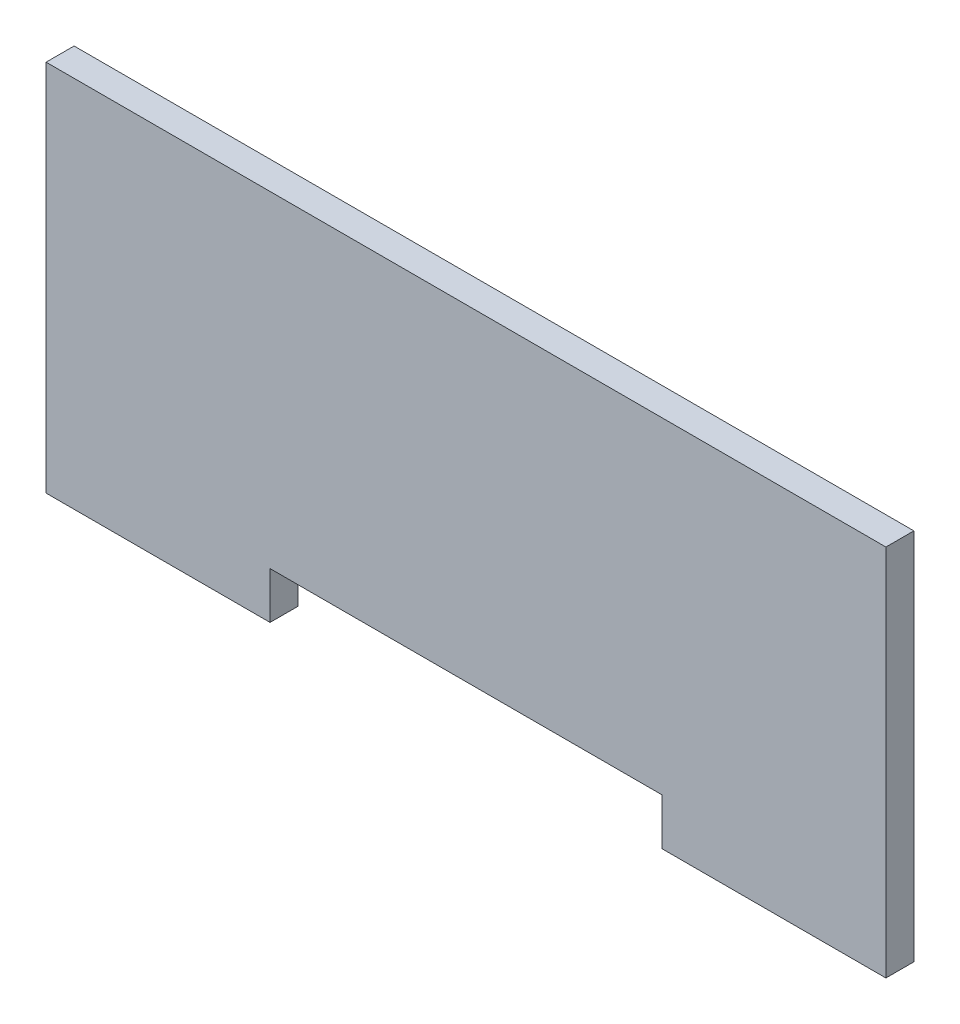
ISO-10303-21;
HEADER;
FILE_DESCRIPTION(('STEP AP214'),'2;1');
FILE_NAME('part.step','',(''),(''),'','','');
FILE_SCHEMA(('AUTOMOTIVE_DESIGN { 1 0 10303 214 1 1 1 1 }'));
ENDSEC;
DATA;
#1=APPLICATION_CONTEXT('core data for automotive mechanical design processes');
#2=APPLICATION_PROTOCOL_DEFINITION('international standard','automotive_design',2000,#1);
#3=PRODUCT_CONTEXT('',#1,'mechanical');
#4=PRODUCT('Part','Part','',(#3));
#5=PRODUCT_RELATED_PRODUCT_CATEGORY('part','',(#4));
#6=PRODUCT_DEFINITION_FORMATION('','',#4);
#7=PRODUCT_DEFINITION_CONTEXT('part definition',#1,'design');
#8=PRODUCT_DEFINITION('design','',#6,#7);
#9=PRODUCT_DEFINITION_SHAPE('','',#8);
#10=(LENGTH_UNIT() NAMED_UNIT(*) SI_UNIT(.MILLI.,.METRE.));
#11=(NAMED_UNIT(*) PLANE_ANGLE_UNIT() SI_UNIT($,.RADIAN.));
#12=(NAMED_UNIT(*) SI_UNIT($,.STERADIAN.) SOLID_ANGLE_UNIT());
#13=UNCERTAINTY_MEASURE_WITH_UNIT(LENGTH_MEASURE(1.E-05),#10,'distance_accuracy_value','');
#14=(GEOMETRIC_REPRESENTATION_CONTEXT(3) GLOBAL_UNCERTAINTY_ASSIGNED_CONTEXT((#13)) GLOBAL_UNIT_ASSIGNED_CONTEXT((#10,
#11,#12)) REPRESENTATION_CONTEXT('',''));
#15=CARTESIAN_POINT('',(0.,0.,0.));
#16=DIRECTION('',(0.,0.,1.));
#17=DIRECTION('',(1.,0.,0.));
#18=AXIS2_PLACEMENT_3D('',#15,#16,#17);
#19=CARTESIAN_POINT('',(-22.6948207171315,30.5659463337186,3.));
#20=DIRECTION('',(1.,0.,0.));
#21=DIRECTION('',(0.,1.,0.));
#22=AXIS2_PLACEMENT_3D('',#19,#20,#21);
#23=PLANE('',#22);
#24=DIRECTION('',(0.,-1.,0.));
#25=VECTOR('',#24,1.);
#26=CARTESIAN_POINT('',(-22.6948207171315,30.5659463337186,0.));
#27=LINE('',#26,#25);
#28=CARTESIAN_POINT('',(-22.6948207171315,30.5659463337186,0.));
#29=VERTEX_POINT('',#28);
#30=CARTESIAN_POINT('',(-22.6948207171315,-9.4340536662814,0.));
#31=VERTEX_POINT('',#30);
#32=EDGE_CURVE('E131',#29,#31,#27,.T.);
#33=ORIENTED_EDGE('',*,*,#32,.T.);
#34=DIRECTION('',(0.,0.,-1.));
#35=VECTOR('',#34,1.);
#36=CARTESIAN_POINT('',(-22.6948207171315,-9.4340536662814,3.));
#37=LINE('',#36,#35);
#38=CARTESIAN_POINT('',(-22.6948207171315,-9.4340536662814,3.));
#39=VERTEX_POINT('',#38);
#40=EDGE_CURVE('E11',#39,#31,#37,.T.);
#41=ORIENTED_EDGE('',*,*,#40,.F.);
#42=DIRECTION('',(0.,-1.,0.));
#43=VECTOR('',#42,1.);
#44=CARTESIAN_POINT('',(-22.6948207171315,30.5659463337186,3.));
#45=LINE('',#44,#43);
#46=CARTESIAN_POINT('',(-22.6948207171315,30.5659463337186,3.));
#47=VERTEX_POINT('',#46);
#48=EDGE_CURVE('E145',#47,#39,#45,.T.);
#49=ORIENTED_EDGE('',*,*,#48,.F.);
#50=DIRECTION('',(0.,0.,-1.));
#51=VECTOR('',#50,1.);
#52=CARTESIAN_POINT('',(-22.6948207171315,30.5659463337186,3.));
#53=LINE('',#52,#51);
#54=EDGE_CURVE('E127',#47,#29,#53,.T.);
#55=ORIENTED_EDGE('',*,*,#54,.T.);
#56=EDGE_LOOP('',(#33,#41,#49,#55));
#57=FACE_BOUND('',#56,.T.);
#58=ADVANCED_FACE('F35',(#57),#23,.F.);
#59=CARTESIAN_POINT('',(-22.6948207171315,-9.4340536662814,3.));
#60=DIRECTION('',(0.,1.,0.));
#61=DIRECTION('',(-1.,0.,0.));
#62=AXIS2_PLACEMENT_3D('',#59,#60,#61);
#63=PLANE('',#62);
#64=DIRECTION('',(1.,0.,0.));
#65=VECTOR('',#64,1.);
#66=CARTESIAN_POINT('',(-22.6948207171315,-9.4340536662814,0.));
#67=LINE('',#66,#65);
#68=CARTESIAN_POINT('',(1.30517928286851,-9.43405366628141,0.));
#69=VERTEX_POINT('',#68);
#70=EDGE_CURVE('E134',#31,#69,#67,.T.);
#71=ORIENTED_EDGE('',*,*,#70,.T.);
#72=DIRECTION('',(0.,0.,-1.));
#73=VECTOR('',#72,1.);
#74=CARTESIAN_POINT('',(1.30517928286851,-9.43405366628141,3.));
#75=LINE('',#74,#73);
#76=CARTESIAN_POINT('',(1.30517928286851,-9.43405366628141,3.));
#77=VERTEX_POINT('',#76);
#78=EDGE_CURVE('E43',#77,#69,#75,.T.);
#79=ORIENTED_EDGE('',*,*,#78,.F.);
#80=DIRECTION('',(1.,0.,0.));
#81=VECTOR('',#80,1.);
#82=CARTESIAN_POINT('',(-22.6948207171315,-9.4340536662814,3.));
#83=LINE('',#82,#81);
#84=EDGE_CURVE('E94',#39,#77,#83,.T.);
#85=ORIENTED_EDGE('',*,*,#84,.F.);
#86=ORIENTED_EDGE('',*,*,#40,.T.);
#87=EDGE_LOOP('',(#71,#79,#85,#86));
#88=FACE_BOUND('',#87,.T.);
#89=ADVANCED_FACE('F180',(#88),#63,.F.);
#90=CARTESIAN_POINT('',(1.30517928286851,-4.43405366628141,3.));
#91=DIRECTION('',(-1.,0.,0.));
#92=DIRECTION('',(0.,0.,1.));
#93=AXIS2_PLACEMENT_3D('',#90,#91,#92);
#94=PLANE('',#93);
#95=DIRECTION('',(0.,1.,0.));
#96=VECTOR('',#95,1.);
#97=CARTESIAN_POINT('',(1.30517928286851,-4.43405366628141,0.));
#98=LINE('',#97,#96);
#99=CARTESIAN_POINT('',(1.30517928286851,-4.43405366628141,0.));
#100=VERTEX_POINT('',#99);
#101=EDGE_CURVE('E136',#69,#100,#98,.T.);
#102=ORIENTED_EDGE('',*,*,#101,.T.);
#103=DIRECTION('',(0.,0.,-1.));
#104=VECTOR('',#103,1.);
#105=CARTESIAN_POINT('',(1.30517928286851,-4.43405366628141,3.));
#106=LINE('',#105,#104);
#107=CARTESIAN_POINT('',(1.30517928286851,-4.43405366628141,3.));
#108=VERTEX_POINT('',#107);
#109=EDGE_CURVE('E152',#108,#100,#106,.T.);
#110=ORIENTED_EDGE('',*,*,#109,.F.);
#111=DIRECTION('',(0.,1.,0.));
#112=VECTOR('',#111,1.);
#113=CARTESIAN_POINT('',(1.30517928286851,-4.43405366628141,3.));
#114=LINE('',#113,#112);
#115=EDGE_CURVE('E160',#77,#108,#114,.T.);
#116=ORIENTED_EDGE('',*,*,#115,.F.);
#117=ORIENTED_EDGE('',*,*,#78,.T.);
#118=EDGE_LOOP('',(#102,#110,#116,#117));
#119=FACE_BOUND('',#118,.T.);
#120=ADVANCED_FACE('F158',(#119),#94,.F.);
#121=CARTESIAN_POINT('',(1.30517928286851,-4.43405366628141,3.));
#122=DIRECTION('',(0.,1.,0.));
#123=DIRECTION('',(-1.,0.,0.));
#124=AXIS2_PLACEMENT_3D('',#121,#122,#123);
#125=PLANE('',#124);
#126=DIRECTION('',(1.,0.,0.));
#127=VECTOR('',#126,1.);
#128=CARTESIAN_POINT('',(1.30517928286851,-4.43405366628141,0.));
#129=LINE('',#128,#127);
#130=CARTESIAN_POINT('',(43.3051792828685,-4.4340536662814,0.));
#131=VERTEX_POINT('',#130);
#132=EDGE_CURVE('E138',#100,#131,#129,.T.);
#133=ORIENTED_EDGE('',*,*,#132,.T.);
#134=DIRECTION('',(0.,0.,-1.));
#135=VECTOR('',#134,1.);
#136=CARTESIAN_POINT('',(43.3051792828685,-4.4340536662814,3.));
#137=LINE('',#136,#135);
#138=CARTESIAN_POINT('',(43.3051792828685,-4.4340536662814,3.));
#139=VERTEX_POINT('',#138);
#140=EDGE_CURVE('E149',#139,#131,#137,.T.);
#141=ORIENTED_EDGE('',*,*,#140,.F.);
#142=DIRECTION('',(1.,0.,0.));
#143=VECTOR('',#142,1.);
#144=CARTESIAN_POINT('',(1.30517928286851,-4.43405366628141,3.));
#145=LINE('',#144,#143);
#146=EDGE_CURVE('E172',#108,#139,#145,.T.);
#147=ORIENTED_EDGE('',*,*,#146,.F.);
#148=ORIENTED_EDGE('',*,*,#109,.T.);
#149=EDGE_LOOP('',(#133,#141,#147,#148));
#150=FACE_BOUND('',#149,.T.);
#151=ADVANCED_FACE('F168',(#150),#125,.F.);
#152=CARTESIAN_POINT('',(43.3051792828685,-4.4340536662814,3.));
#153=DIRECTION('',(1.,0.,0.));
#154=DIRECTION('',(0.,1.,0.));
#155=AXIS2_PLACEMENT_3D('',#152,#153,#154);
#156=PLANE('',#155);
#157=DIRECTION('',(0.,-1.,0.));
#158=VECTOR('',#157,1.);
#159=CARTESIAN_POINT('',(43.3051792828685,-4.4340536662814,0.));
#160=LINE('',#159,#158);
#161=CARTESIAN_POINT('',(43.3051792828685,-9.4340536662814,0.));
#162=VERTEX_POINT('',#161);
#163=EDGE_CURVE('E140',#131,#162,#160,.T.);
#164=ORIENTED_EDGE('',*,*,#163,.T.);
#165=DIRECTION('',(0.,0.,-1.));
#166=VECTOR('',#165,1.);
#167=CARTESIAN_POINT('',(43.3051792828685,-9.4340536662814,3.));
#168=LINE('',#167,#166);
#169=CARTESIAN_POINT('',(43.3051792828685,-9.4340536662814,3.));
#170=VERTEX_POINT('',#169);
#171=EDGE_CURVE('E122',#170,#162,#168,.T.);
#172=ORIENTED_EDGE('',*,*,#171,.F.);
#173=DIRECTION('',(0.,-1.,0.));
#174=VECTOR('',#173,1.);
#175=CARTESIAN_POINT('',(43.3051792828685,-4.4340536662814,3.));
#176=LINE('',#175,#174);
#177=EDGE_CURVE('E113',#139,#170,#176,.T.);
#178=ORIENTED_EDGE('',*,*,#177,.F.);
#179=ORIENTED_EDGE('',*,*,#140,.T.);
#180=EDGE_LOOP('',(#164,#172,#178,#179));
#181=FACE_BOUND('',#180,.T.);
#182=ADVANCED_FACE('F171',(#181),#156,.F.);
#183=CARTESIAN_POINT('',(43.3051792828685,-9.4340536662814,3.));
#184=DIRECTION('',(0.,1.,0.));
#185=DIRECTION('',(0.,0.,1.));
#186=AXIS2_PLACEMENT_3D('',#183,#184,#185);
#187=PLANE('',#186);
#188=DIRECTION('',(1.,0.,0.));
#189=VECTOR('',#188,1.);
#190=CARTESIAN_POINT('',(43.3051792828685,-9.4340536662814,0.));
#191=LINE('',#190,#189);
#192=CARTESIAN_POINT('',(67.3051792828685,-9.4340536662814,0.));
#193=VERTEX_POINT('',#192);
#194=EDGE_CURVE('E121',#162,#193,#191,.T.);
#195=ORIENTED_EDGE('',*,*,#194,.T.);
#196=DIRECTION('',(0.,0.,-1.));
#197=VECTOR('',#196,1.);
#198=CARTESIAN_POINT('',(67.3051792828685,-9.4340536662814,3.));
#199=LINE('',#198,#197);
#200=CARTESIAN_POINT('',(67.3051792828685,-9.4340536662814,3.));
#201=VERTEX_POINT('',#200);
#202=EDGE_CURVE('E118',#201,#193,#199,.T.);
#203=ORIENTED_EDGE('',*,*,#202,.F.);
#204=DIRECTION('',(1.,0.,0.));
#205=VECTOR('',#204,1.);
#206=CARTESIAN_POINT('',(43.3051792828685,-9.4340536662814,3.));
#207=LINE('',#206,#205);
#208=EDGE_CURVE('E107',#170,#201,#207,.T.);
#209=ORIENTED_EDGE('',*,*,#208,.F.);
#210=ORIENTED_EDGE('',*,*,#171,.T.);
#211=EDGE_LOOP('',(#195,#203,#209,#210));
#212=FACE_BOUND('',#211,.T.);
#213=ADVANCED_FACE('F119',(#212),#187,.F.);
#214=CARTESIAN_POINT('',(67.3051792828685,30.5659463337186,3.));
#215=DIRECTION('',(-1.,0.,0.));
#216=DIRECTION('',(0.,0.,1.));
#217=AXIS2_PLACEMENT_3D('',#214,#215,#216);
#218=PLANE('',#217);
#219=DIRECTION('',(0.,1.,0.));
#220=VECTOR('',#219,1.);
#221=CARTESIAN_POINT('',(67.3051792828685,30.5659463337186,0.));
#222=LINE('',#221,#220);
#223=CARTESIAN_POINT('',(67.3051792828685,30.5659463337186,0.));
#224=VERTEX_POINT('',#223);
#225=EDGE_CURVE('E80',#193,#224,#222,.T.);
#226=ORIENTED_EDGE('',*,*,#225,.T.);
#227=DIRECTION('',(0.,0.,-1.));
#228=VECTOR('',#227,1.);
#229=CARTESIAN_POINT('',(67.3051792828685,30.5659463337186,3.));
#230=LINE('',#229,#228);
#231=CARTESIAN_POINT('',(67.3051792828685,30.5659463337186,3.));
#232=VERTEX_POINT('',#231);
#233=EDGE_CURVE('E123',#232,#224,#230,.T.);
#234=ORIENTED_EDGE('',*,*,#233,.F.);
#235=DIRECTION('',(0.,1.,0.));
#236=VECTOR('',#235,1.);
#237=CARTESIAN_POINT('',(67.3051792828685,30.5659463337186,3.));
#238=LINE('',#237,#236);
#239=EDGE_CURVE('E111',#201,#232,#238,.T.);
#240=ORIENTED_EDGE('',*,*,#239,.F.);
#241=ORIENTED_EDGE('',*,*,#202,.T.);
#242=EDGE_LOOP('',(#226,#234,#240,#241));
#243=FACE_BOUND('',#242,.T.);
#244=ADVANCED_FACE('F125',(#243),#218,.F.);
#245=CARTESIAN_POINT('',(-22.6948207171315,30.5659463337186,3.));
#246=DIRECTION('',(0.,-1.,0.));
#247=DIRECTION('',(0.,0.,-1.));
#248=AXIS2_PLACEMENT_3D('',#245,#246,#247);
#249=PLANE('',#248);
#250=DIRECTION('',(-1.,0.,0.));
#251=VECTOR('',#250,1.);
#252=CARTESIAN_POINT('',(-22.6948207171315,30.5659463337186,0.));
#253=LINE('',#252,#251);
#254=EDGE_CURVE('E86',#224,#29,#253,.T.);
#255=ORIENTED_EDGE('',*,*,#254,.T.);
#256=ORIENTED_EDGE('',*,*,#54,.F.);
#257=DIRECTION('',(-1.,0.,0.));
#258=VECTOR('',#257,1.);
#259=CARTESIAN_POINT('',(-22.6948207171315,30.5659463337186,3.));
#260=LINE('',#259,#258);
#261=EDGE_CURVE('E51',#232,#47,#260,.T.);
#262=ORIENTED_EDGE('',*,*,#261,.F.);
#263=ORIENTED_EDGE('',*,*,#233,.T.);
#264=EDGE_LOOP('',(#255,#256,#262,#263));
#265=FACE_BOUND('',#264,.T.);
#266=ADVANCED_FACE('F196',(#265),#249,.F.);
#267=CARTESIAN_POINT('',(0.,0.,3.));
#268=DIRECTION('',(0.,0.,1.));
#269=DIRECTION('',(1.,0.,0.));
#270=AXIS2_PLACEMENT_3D('',#267,#268,#269);
#271=PLANE('',#270);
#272=ORIENTED_EDGE('',*,*,#48,.T.);
#273=ORIENTED_EDGE('',*,*,#84,.T.);
#274=ORIENTED_EDGE('',*,*,#115,.T.);
#275=ORIENTED_EDGE('',*,*,#146,.T.);
#276=ORIENTED_EDGE('',*,*,#177,.T.);
#277=ORIENTED_EDGE('',*,*,#208,.T.);
#278=ORIENTED_EDGE('',*,*,#239,.T.);
#279=ORIENTED_EDGE('',*,*,#261,.T.);
#280=EDGE_LOOP('',(#272,#273,#274,#275,#276,#277,#278,#279));
#281=FACE_BOUND('',#280,.T.);
#282=ADVANCED_FACE('F109',(#281),#271,.T.);
#283=CARTESIAN_POINT('',(0.,0.,0.));
#284=DIRECTION('',(0.,0.,1.));
#285=DIRECTION('',(1.,0.,0.));
#286=AXIS2_PLACEMENT_3D('',#283,#284,#285);
#287=PLANE('',#286);
#288=ORIENTED_EDGE('',*,*,#32,.F.);
#289=ORIENTED_EDGE('',*,*,#254,.F.);
#290=ORIENTED_EDGE('',*,*,#225,.F.);
#291=ORIENTED_EDGE('',*,*,#194,.F.);
#292=ORIENTED_EDGE('',*,*,#163,.F.);
#293=ORIENTED_EDGE('',*,*,#132,.F.);
#294=ORIENTED_EDGE('',*,*,#101,.F.);
#295=ORIENTED_EDGE('',*,*,#70,.F.);
#296=EDGE_LOOP('',(#288,#289,#290,#291,#292,#293,#294,#295));
#297=FACE_BOUND('',#296,.T.);
#298=ADVANCED_FACE('F164',(#297),#287,.F.);
#299=CLOSED_SHELL('',(#58,#89,#120,#151,#182,#213,#244,#266,#282,#298));
#300=MANIFOLD_SOLID_BREP('B2',#299);
#301=ADVANCED_BREP_SHAPE_REPRESENTATION('',(#18,#300),#14);
#302=SHAPE_DEFINITION_REPRESENTATION(#9,#301);
ENDSEC;
END-ISO-10303-21;
